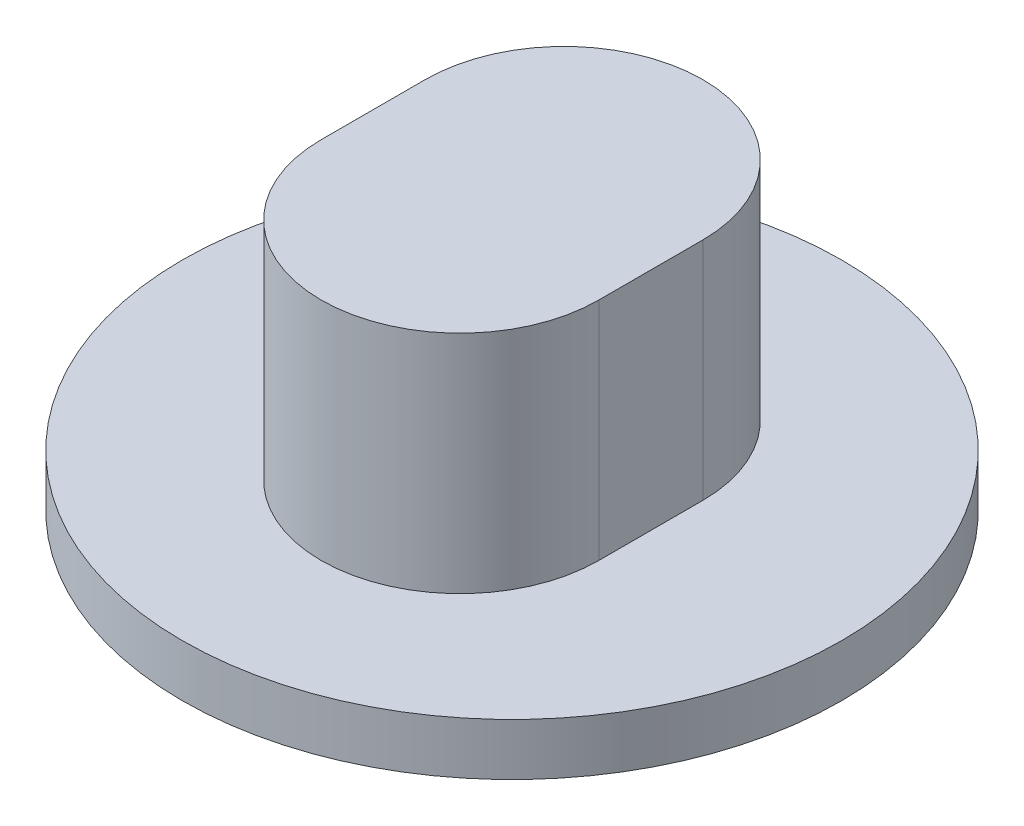
ISO-10303-21;
HEADER;
FILE_DESCRIPTION(('STEP AP214'),'2;1');
FILE_NAME('part.step','',(''),(''),'','','');
FILE_SCHEMA(('AUTOMOTIVE_DESIGN { 1 0 10303 214 1 1 1 1 }'));
ENDSEC;
DATA;
#1=APPLICATION_CONTEXT('core data for automotive mechanical design processes');
#2=APPLICATION_PROTOCOL_DEFINITION('international standard','automotive_design',2000,#1);
#3=PRODUCT_CONTEXT('',#1,'mechanical');
#4=PRODUCT('Part','Part','',(#3));
#5=PRODUCT_RELATED_PRODUCT_CATEGORY('part','',(#4));
#6=PRODUCT_DEFINITION_FORMATION('','',#4);
#7=PRODUCT_DEFINITION_CONTEXT('part definition',#1,'design');
#8=PRODUCT_DEFINITION('design','',#6,#7);
#9=PRODUCT_DEFINITION_SHAPE('','',#8);
#10=(LENGTH_UNIT() NAMED_UNIT(*) SI_UNIT(.MILLI.,.METRE.));
#11=(NAMED_UNIT(*) PLANE_ANGLE_UNIT() SI_UNIT($,.RADIAN.));
#12=(NAMED_UNIT(*) SI_UNIT($,.STERADIAN.) SOLID_ANGLE_UNIT());
#13=UNCERTAINTY_MEASURE_WITH_UNIT(LENGTH_MEASURE(1.E-05),#10,'distance_accuracy_value','');
#14=(GEOMETRIC_REPRESENTATION_CONTEXT(3) GLOBAL_UNCERTAINTY_ASSIGNED_CONTEXT((#13)) GLOBAL_UNIT_ASSIGNED_CONTEXT((#10,
#11,#12)) REPRESENTATION_CONTEXT('',''));
#15=CARTESIAN_POINT('',(0.,0.,0.));
#16=DIRECTION('',(0.,0.,1.));
#17=DIRECTION('',(1.,0.,0.));
#18=AXIS2_PLACEMENT_3D('',#15,#16,#17);
#19=CARTESIAN_POINT('',(0.,3.,0.));
#20=DIRECTION('',(0.,1.,0.));
#21=DIRECTION('',(0.,0.,1.));
#22=AXIS2_PLACEMENT_3D('',#19,#20,#21);
#23=PLANE('',#22);
#24=CARTESIAN_POINT('',(0.,3.,0.));
#25=DIRECTION('',(0.,1.,0.));
#26=DIRECTION('',(0.,0.,1.));
#27=AXIS2_PLACEMENT_3D('',#24,#25,#26);
#28=CIRCLE('',#27,19.);
#29=CARTESIAN_POINT('',(0.,3.,19.));
#30=VERTEX_POINT('',#29);
#31=EDGE_CURVE('E11',#30,#30,#28,.T.);
#32=ORIENTED_EDGE('',*,*,#31,.T.);
#33=EDGE_LOOP('',(#32));
#34=FACE_BOUND('',#33,.T.);
#35=DIRECTION('',(0.,0.,-1.));
#36=VECTOR('',#35,1.);
#37=CARTESIAN_POINT('',(8.,3.,3.));
#38=LINE('',#37,#36);
#39=CARTESIAN_POINT('',(8.,3.,3.));
#40=VERTEX_POINT('',#39);
#41=CARTESIAN_POINT('',(8.,3.,-3.));
#42=VERTEX_POINT('',#41);
#43=EDGE_CURVE('E89',#40,#42,#38,.T.);
#44=ORIENTED_EDGE('',*,*,#43,.F.);
#45=CARTESIAN_POINT('',(0.,3.,3.));
#46=DIRECTION('',(0.,1.,0.));
#47=DIRECTION('',(0.,0.,1.));
#48=AXIS2_PLACEMENT_3D('',#45,#46,#47);
#49=CIRCLE('',#48,8.);
#50=CARTESIAN_POINT('',(-8.,3.,3.));
#51=VERTEX_POINT('',#50);
#52=EDGE_CURVE('E100',#51,#40,#49,.T.);
#53=ORIENTED_EDGE('',*,*,#52,.F.);
#54=DIRECTION('',(0.,0.,1.));
#55=VECTOR('',#54,1.);
#56=CARTESIAN_POINT('',(-8.,3.,3.));
#57=LINE('',#56,#55);
#58=CARTESIAN_POINT('',(-8.,3.,-3.));
#59=VERTEX_POINT('',#58);
#60=EDGE_CURVE('E70',#59,#51,#57,.T.);
#61=ORIENTED_EDGE('',*,*,#60,.F.);
#62=CARTESIAN_POINT('',(0.,3.,-3.));
#63=DIRECTION('',(0.,1.,0.));
#64=DIRECTION('',(0.,0.,1.));
#65=AXIS2_PLACEMENT_3D('',#62,#63,#64);
#66=CIRCLE('',#65,8.);
#67=EDGE_CURVE('E104',#42,#59,#66,.T.);
#68=ORIENTED_EDGE('',*,*,#67,.F.);
#69=EDGE_LOOP('',(#44,#53,#61,#68));
#70=FACE_BOUND('',#69,.T.);
#71=ADVANCED_FACE('F33',(#34,#70),#23,.T.);
#72=CARTESIAN_POINT('',(0.,3.,0.));
#73=DIRECTION('',(0.,-1.,0.));
#74=DIRECTION('',(0.,0.,-1.));
#75=AXIS2_PLACEMENT_3D('',#72,#73,#74);
#76=CYLINDRICAL_SURFACE('',#75,19.);
#77=ORIENTED_EDGE('',*,*,#31,.F.);
#78=EDGE_LOOP('',(#77));
#79=FACE_BOUND('',#78,.T.);
#80=CARTESIAN_POINT('',(0.,0.,0.));
#81=DIRECTION('',(0.,1.,0.));
#82=DIRECTION('',(0.,0.,1.));
#83=AXIS2_PLACEMENT_3D('',#80,#81,#82);
#84=CIRCLE('',#83,19.);
#85=CARTESIAN_POINT('',(0.,0.,19.));
#86=VERTEX_POINT('',#85);
#87=EDGE_CURVE('E37',#86,#86,#84,.T.);
#88=ORIENTED_EDGE('',*,*,#87,.T.);
#89=EDGE_LOOP('',(#88));
#90=FACE_BOUND('',#89,.T.);
#91=ADVANCED_FACE('F35',(#79,#90),#76,.T.);
#92=CARTESIAN_POINT('',(0.,0.,0.));
#93=DIRECTION('',(0.,1.,0.));
#94=DIRECTION('',(0.,0.,1.));
#95=AXIS2_PLACEMENT_3D('',#92,#93,#94);
#96=PLANE('',#95);
#97=ORIENTED_EDGE('',*,*,#87,.F.);
#98=EDGE_LOOP('',(#97));
#99=FACE_BOUND('',#98,.T.);
#100=ADVANCED_FACE('F113',(#99),#96,.F.);
#101=CARTESIAN_POINT('',(0.,16.,3.));
#102=DIRECTION('',(0.,-1.,0.));
#103=DIRECTION('',(0.,0.,-1.));
#104=AXIS2_PLACEMENT_3D('',#101,#102,#103);
#105=CYLINDRICAL_SURFACE('',#104,8.);
#106=ORIENTED_EDGE('',*,*,#52,.T.);
#107=DIRECTION('',(0.,-1.,0.));
#108=VECTOR('',#107,1.);
#109=CARTESIAN_POINT('',(8.,16.,3.));
#110=LINE('',#109,#108);
#111=CARTESIAN_POINT('',(8.,16.,3.));
#112=VERTEX_POINT('',#111);
#113=EDGE_CURVE('E92',#112,#40,#110,.T.);
#114=ORIENTED_EDGE('',*,*,#113,.F.);
#115=CARTESIAN_POINT('',(0.,16.,3.));
#116=DIRECTION('',(0.,1.,0.));
#117=DIRECTION('',(0.,0.,1.));
#118=AXIS2_PLACEMENT_3D('',#115,#116,#117);
#119=CIRCLE('',#118,8.);
#120=CARTESIAN_POINT('',(-8.,16.,3.));
#121=VERTEX_POINT('',#120);
#122=EDGE_CURVE('E82',#121,#112,#119,.T.);
#123=ORIENTED_EDGE('',*,*,#122,.F.);
#124=DIRECTION('',(0.,-1.,0.));
#125=VECTOR('',#124,1.);
#126=CARTESIAN_POINT('',(-8.,16.,3.));
#127=LINE('',#126,#125);
#128=EDGE_CURVE('E96',#121,#51,#127,.T.);
#129=ORIENTED_EDGE('',*,*,#128,.T.);
#130=EDGE_LOOP('',(#106,#114,#123,#129));
#131=FACE_BOUND('',#130,.T.);
#132=ADVANCED_FACE('F115',(#131),#105,.T.);
#133=CARTESIAN_POINT('',(8.,16.,3.));
#134=DIRECTION('',(-1.,0.,0.));
#135=DIRECTION('',(0.,0.,1.));
#136=AXIS2_PLACEMENT_3D('',#133,#134,#135);
#137=PLANE('',#136);
#138=ORIENTED_EDGE('',*,*,#43,.T.);
#139=DIRECTION('',(0.,-1.,0.));
#140=VECTOR('',#139,1.);
#141=CARTESIAN_POINT('',(8.,16.,-3.));
#142=LINE('',#141,#140);
#143=CARTESIAN_POINT('',(8.,16.,-3.));
#144=VERTEX_POINT('',#143);
#145=EDGE_CURVE('E86',#144,#42,#142,.T.);
#146=ORIENTED_EDGE('',*,*,#145,.F.);
#147=DIRECTION('',(0.,0.,-1.));
#148=VECTOR('',#147,1.);
#149=CARTESIAN_POINT('',(8.,16.,3.));
#150=LINE('',#149,#148);
#151=EDGE_CURVE('E77',#112,#144,#150,.T.);
#152=ORIENTED_EDGE('',*,*,#151,.F.);
#153=ORIENTED_EDGE('',*,*,#113,.T.);
#154=EDGE_LOOP('',(#138,#146,#152,#153));
#155=FACE_BOUND('',#154,.T.);
#156=ADVANCED_FACE('F87',(#155),#137,.F.);
#157=CARTESIAN_POINT('',(0.,16.,-3.));
#158=DIRECTION('',(0.,-1.,0.));
#159=DIRECTION('',(0.,0.,-1.));
#160=AXIS2_PLACEMENT_3D('',#157,#158,#159);
#161=CYLINDRICAL_SURFACE('',#160,8.);
#162=ORIENTED_EDGE('',*,*,#67,.T.);
#163=DIRECTION('',(0.,-1.,0.));
#164=VECTOR('',#163,1.);
#165=CARTESIAN_POINT('',(-8.,16.,-3.));
#166=LINE('',#165,#164);
#167=CARTESIAN_POINT('',(-8.,16.,-3.));
#168=VERTEX_POINT('',#167);
#169=EDGE_CURVE('E48',#168,#59,#166,.T.);
#170=ORIENTED_EDGE('',*,*,#169,.F.);
#171=CARTESIAN_POINT('',(0.,16.,-3.));
#172=DIRECTION('',(0.,1.,0.));
#173=DIRECTION('',(0.,0.,1.));
#174=AXIS2_PLACEMENT_3D('',#171,#172,#173);
#175=CIRCLE('',#174,8.);
#176=EDGE_CURVE('E80',#144,#168,#175,.T.);
#177=ORIENTED_EDGE('',*,*,#176,.F.);
#178=ORIENTED_EDGE('',*,*,#145,.T.);
#179=EDGE_LOOP('',(#162,#170,#177,#178));
#180=FACE_BOUND('',#179,.T.);
#181=ADVANCED_FACE('F94',(#180),#161,.T.);
#182=CARTESIAN_POINT('',(-8.,16.,3.));
#183=DIRECTION('',(1.,0.,0.));
#184=DIRECTION('',(0.,0.,-1.));
#185=AXIS2_PLACEMENT_3D('',#182,#183,#184);
#186=PLANE('',#185);
#187=ORIENTED_EDGE('',*,*,#60,.T.);
#188=ORIENTED_EDGE('',*,*,#128,.F.);
#189=DIRECTION('',(0.,0.,1.));
#190=VECTOR('',#189,1.);
#191=CARTESIAN_POINT('',(-8.,16.,3.));
#192=LINE('',#191,#190);
#193=EDGE_CURVE('E56',#168,#121,#192,.T.);
#194=ORIENTED_EDGE('',*,*,#193,.F.);
#195=ORIENTED_EDGE('',*,*,#169,.T.);
#196=EDGE_LOOP('',(#187,#188,#194,#195));
#197=FACE_BOUND('',#196,.T.);
#198=ADVANCED_FACE('F134',(#197),#186,.F.);
#199=CARTESIAN_POINT('',(0.,16.,3.));
#200=DIRECTION('',(0.,1.,0.));
#201=DIRECTION('',(0.,0.,1.));
#202=AXIS2_PLACEMENT_3D('',#199,#200,#201);
#203=PLANE('',#202);
#204=ORIENTED_EDGE('',*,*,#122,.T.);
#205=ORIENTED_EDGE('',*,*,#151,.T.);
#206=ORIENTED_EDGE('',*,*,#176,.T.);
#207=ORIENTED_EDGE('',*,*,#193,.T.);
#208=EDGE_LOOP('',(#204,#205,#206,#207));
#209=FACE_BOUND('',#208,.T.);
#210=ADVANCED_FACE('F78',(#209),#203,.T.);
#211=CLOSED_SHELL('',(#71,#91,#100,#132,#156,#181,#198,#210));
#212=MANIFOLD_SOLID_BREP('B2',#211);
#213=ADVANCED_BREP_SHAPE_REPRESENTATION('',(#18,#212),#14);
#214=SHAPE_DEFINITION_REPRESENTATION(#9,#213);
ENDSEC;
END-ISO-10303-21;
